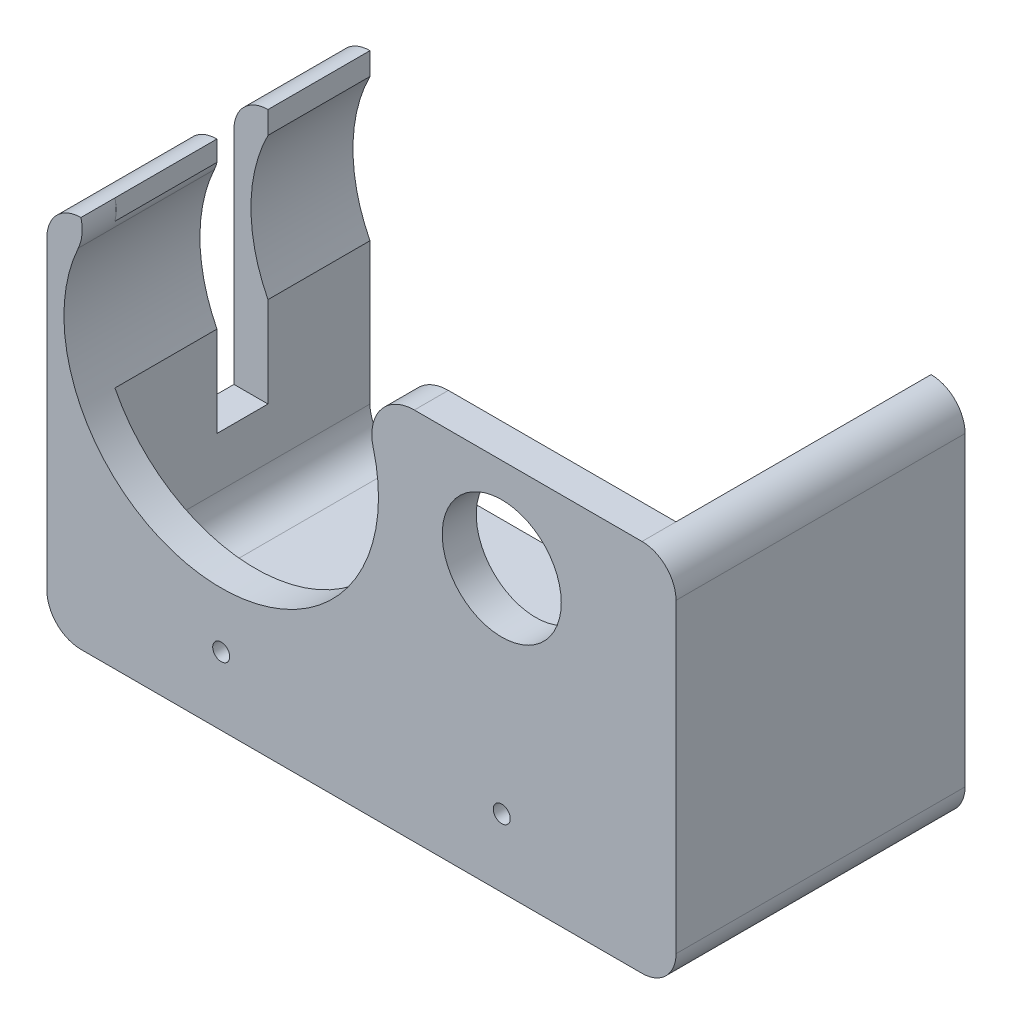
ISO-10303-21;
HEADER;
FILE_DESCRIPTION(('STEP AP214'),'2;1');
FILE_NAME('part.step','',(''),(''),'','','');
FILE_SCHEMA(('AUTOMOTIVE_DESIGN { 1 0 10303 214 1 1 1 1 }'));
ENDSEC;
DATA;
#1=APPLICATION_CONTEXT('core data for automotive mechanical design processes');
#2=APPLICATION_PROTOCOL_DEFINITION('international standard','automotive_design',2000,#1);
#3=PRODUCT_CONTEXT('',#1,'mechanical');
#4=PRODUCT('Part','Part','',(#3));
#5=PRODUCT_RELATED_PRODUCT_CATEGORY('part','',(#4));
#6=PRODUCT_DEFINITION_FORMATION('','',#4);
#7=PRODUCT_DEFINITION_CONTEXT('part definition',#1,'design');
#8=PRODUCT_DEFINITION('design','',#6,#7);
#9=PRODUCT_DEFINITION_SHAPE('','',#8);
#10=(LENGTH_UNIT() NAMED_UNIT(*) SI_UNIT(.MILLI.,.METRE.));
#11=(NAMED_UNIT(*) PLANE_ANGLE_UNIT() SI_UNIT($,.RADIAN.));
#12=(NAMED_UNIT(*) SI_UNIT($,.STERADIAN.) SOLID_ANGLE_UNIT());
#13=UNCERTAINTY_MEASURE_WITH_UNIT(LENGTH_MEASURE(1.E-05),#10,'distance_accuracy_value','');
#14=(GEOMETRIC_REPRESENTATION_CONTEXT(3) GLOBAL_UNCERTAINTY_ASSIGNED_CONTEXT((#13)) GLOBAL_UNIT_ASSIGNED_CONTEXT((#10,
#11,#12)) REPRESENTATION_CONTEXT('',''));
#15=CARTESIAN_POINT('',(0.,0.,0.));
#16=DIRECTION('',(0.,0.,1.));
#17=DIRECTION('',(1.,0.,0.));
#18=AXIS2_PLACEMENT_3D('',#15,#16,#17);
#19=CARTESIAN_POINT('',(-37.2261613691932,29.0880195599022,0.));
#20=DIRECTION('',(0.,0.,1.));
#21=DIRECTION('',(1.,0.,0.));
#22=AXIS2_PLACEMENT_3D('',#19,#20,#21);
#23=CYLINDRICAL_SURFACE('',#22,18.5);
#24=DIRECTION('',(0.,0.,1.));
#25=VECTOR('',#24,1.);
#26=CARTESIAN_POINT('',(-53.7261613691931,37.454619825243,-30.));
#27=LINE('',#26,#25);
#28=CARTESIAN_POINT('',(-53.7261613691931,37.454619825243,-30.));
#29=VERTEX_POINT('',#28);
#30=CARTESIAN_POINT('',(-53.7261613691931,37.454619825243,-18.));
#31=VERTEX_POINT('',#30);
#32=EDGE_CURVE('E355',#29,#31,#27,.T.);
#33=ORIENTED_EDGE('',*,*,#32,.T.);
#34=CARTESIAN_POINT('',(-37.2261613691932,29.0880195599022,-18.));
#35=DIRECTION('',(0.,0.,-1.));
#36=DIRECTION('',(0.,1.,0.));
#37=AXIS2_PLACEMENT_3D('',#34,#35,#36);
#38=CIRCLE('',#37,18.5);
#39=CARTESIAN_POINT('',(-53.7261613691932,20.7214192945614,-18.));
#40=VERTEX_POINT('',#39);
#41=EDGE_CURVE('E297',#31,#40,#38,.F.);
#42=ORIENTED_EDGE('',*,*,#41,.T.);
#43=DIRECTION('',(0.,0.,1.));
#44=VECTOR('',#43,1.);
#45=CARTESIAN_POINT('',(-53.7261613691931,20.7214192945614,-30.));
#46=LINE('',#45,#44);
#47=CARTESIAN_POINT('',(-53.7261613691931,20.7214192945614,-30.));
#48=VERTEX_POINT('',#47);
#49=EDGE_CURVE('E351',#48,#40,#46,.T.);
#50=ORIENTED_EDGE('',*,*,#49,.F.);
#51=CARTESIAN_POINT('',(-37.2261613691932,29.0880195599022,-30.));
#52=DIRECTION('',(0.,0.,-1.));
#53=DIRECTION('',(-1.,0.,0.));
#54=AXIS2_PLACEMENT_3D('',#51,#52,#53);
#55=CIRCLE('',#54,18.5);
#56=EDGE_CURVE('E326',#29,#48,#55,.F.);
#57=ORIENTED_EDGE('',*,*,#56,.F.);
#58=EDGE_LOOP('',(#33,#42,#50,#57));
#59=FACE_BOUND('',#58,.T.);
#60=ADVANCED_FACE('F41',(#59),#23,.F.);
#61=CARTESIAN_POINT('',(-53.7261613691932,0.,-30.));
#62=DIRECTION('',(-1.,0.,0.));
#63=DIRECTION('',(0.,-1.,0.));
#64=AXIS2_PLACEMENT_3D('',#61,#62,#63);
#65=PLANE('',#64);
#66=DIRECTION('',(0.,0.,1.));
#67=VECTOR('',#66,1.);
#68=CARTESIAN_POINT('',(-53.7261613691931,40.0880195599022,-30.));
#69=LINE('',#68,#67);
#70=CARTESIAN_POINT('',(-53.7261613691931,40.0880195599022,-30.));
#71=VERTEX_POINT('',#70);
#72=CARTESIAN_POINT('',(-53.7261613691932,40.0880195599022,-18.));
#73=VERTEX_POINT('',#72);
#74=EDGE_CURVE('E360',#71,#73,#69,.T.);
#75=ORIENTED_EDGE('',*,*,#74,.T.);
#76=DIRECTION('',(0.,-1.,0.));
#77=VECTOR('',#76,1.);
#78=CARTESIAN_POINT('',(-53.7261613691932,0.,-18.));
#79=LINE('',#78,#77);
#80=EDGE_CURVE('E293',#73,#31,#79,.T.);
#81=ORIENTED_EDGE('',*,*,#80,.T.);
#82=ORIENTED_EDGE('',*,*,#32,.F.);
#83=DIRECTION('',(0.,-1.,0.));
#84=VECTOR('',#83,1.);
#85=CARTESIAN_POINT('',(-53.7261613691932,0.,-30.));
#86=LINE('',#85,#84);
#87=EDGE_CURVE('E323',#71,#29,#86,.T.);
#88=ORIENTED_EDGE('',*,*,#87,.F.);
#89=EDGE_LOOP('',(#75,#81,#82,#88));
#90=FACE_BOUND('',#89,.T.);
#91=ADVANCED_FACE('F599',(#90),#65,.F.);
#92=CARTESIAN_POINT('',(-53.7261613691932,36.0880195599022,4.));
#93=DIRECTION('',(0.,0.,-1.));
#94=DIRECTION('',(-1.,0.,0.));
#95=AXIS2_PLACEMENT_3D('',#92,#93,#94);
#96=CYLINDRICAL_SURFACE('',#95,4.);
#97=CARTESIAN_POINT('',(-53.7261613691932,36.0880195599022,-18.));
#98=DIRECTION('',(0.,0.,-1.));
#99=DIRECTION('',(0.,1.,0.));
#100=AXIS2_PLACEMENT_3D('',#97,#98,#99);
#101=CIRCLE('',#100,4.);
#102=CARTESIAN_POINT('',(-57.7261613691932,36.0880195599022,-18.));
#103=VERTEX_POINT('',#102);
#104=EDGE_CURVE('E491',#73,#103,#101,.F.);
#105=ORIENTED_EDGE('',*,*,#104,.F.);
#106=ORIENTED_EDGE('',*,*,#74,.F.);
#107=CARTESIAN_POINT('',(-53.7261613691932,36.0880195599022,-30.));
#108=DIRECTION('',(0.,0.,-1.));
#109=DIRECTION('',(-1.,0.,0.));
#110=AXIS2_PLACEMENT_3D('',#107,#108,#109);
#111=CIRCLE('',#110,4.);
#112=CARTESIAN_POINT('',(-57.7261613691932,36.0880195599022,-30.));
#113=VERTEX_POINT('',#112);
#114=EDGE_CURVE('E430',#113,#71,#111,.T.);
#115=ORIENTED_EDGE('',*,*,#114,.F.);
#116=DIRECTION('',(0.,0.,-1.));
#117=VECTOR('',#116,1.);
#118=CARTESIAN_POINT('',(-57.7261613691932,36.0880195599022,4.));
#119=LINE('',#118,#117);
#120=EDGE_CURVE('E439',#103,#113,#119,.T.);
#121=ORIENTED_EDGE('',*,*,#120,.F.);
#122=EDGE_LOOP('',(#105,#106,#115,#121));
#123=FACE_BOUND('',#122,.T.);
#124=ADVANCED_FACE('F595',(#123),#96,.T.);
#125=CARTESIAN_POINT('',(0.,0.,0.));
#126=DIRECTION('',(0.,0.,1.));
#127=DIRECTION('',(1.,0.,0.));
#128=AXIS2_PLACEMENT_3D('',#125,#126,#127);
#129=PLANE('',#128);
#130=DIRECTION('',(0.,-1.,0.));
#131=VECTOR('',#130,1.);
#132=CARTESIAN_POINT('',(-53.7261613691932,0.,0.));
#133=LINE('',#132,#131);
#134=CARTESIAN_POINT('',(-53.7261613691931,40.0880195599022,0.));
#135=VERTEX_POINT('',#134);
#136=CARTESIAN_POINT('',(-53.7261613691931,37.7027862382972,0.));
#137=VERTEX_POINT('',#136);
#138=EDGE_CURVE('E338',#135,#137,#133,.T.);
#139=ORIENTED_EDGE('',*,*,#138,.F.);
#140=CARTESIAN_POINT('',(-58.5818452036676,38.8954028990997,0.));
#141=DIRECTION('',(0.,0.,1.));
#142=DIRECTION('',(1.,0.,0.));
#143=AXIS2_PLACEMENT_3D('',#140,#141,#142);
#144=CIRCLE('',#143,5.);
#145=EDGE_CURVE('E498',#135,#137,#144,.F.);
#146=ORIENTED_EDGE('',*,*,#145,.T.);
#147=EDGE_LOOP('',(#139,#146));
#148=FACE_BOUND('',#147,.T.);
#149=ADVANCED_FACE('F662',(#148),#129,.F.);
#150=CARTESIAN_POINT('',(-57.7261613691932,40.0880195599022,4.));
#151=DIRECTION('',(0.,-1.,0.));
#152=DIRECTION('',(0.,0.,-1.));
#153=AXIS2_PLACEMENT_3D('',#150,#151,#152);
#154=PLANE('',#153);
#155=DIRECTION('',(-1.,0.,0.));
#156=VECTOR('',#155,1.);
#157=CARTESIAN_POINT('',(-57.7261613691932,40.0880195599022,0.));
#158=LINE('',#157,#156);
#159=CARTESIAN_POINT('',(12.2738386308068,40.0880195599022,0.));
#160=VERTEX_POINT('',#159);
#161=CARTESIAN_POINT('',(-14.5050258341896,40.0880195599022,0.));
#162=VERTEX_POINT('',#161);
#163=EDGE_CURVE('E395',#160,#162,#158,.T.);
#164=ORIENTED_EDGE('',*,*,#163,.T.);
#165=DIRECTION('',(0.,0.,1.));
#166=VECTOR('',#165,1.);
#167=CARTESIAN_POINT('',(-14.5050258341896,40.0880195599022,4.));
#168=LINE('',#167,#166);
#169=CARTESIAN_POINT('',(-14.5050258341896,40.0880195599022,4.));
#170=VERTEX_POINT('',#169);
#171=EDGE_CURVE('E50',#162,#170,#168,.T.);
#172=ORIENTED_EDGE('',*,*,#171,.T.);
#173=DIRECTION('',(-1.,0.,0.));
#174=VECTOR('',#173,1.);
#175=CARTESIAN_POINT('',(-57.7261613691932,40.0880195599022,4.));
#176=LINE('',#175,#174);
#177=CARTESIAN_POINT('',(12.2738386308068,40.0880195599022,4.));
#178=VERTEX_POINT('',#177);
#179=EDGE_CURVE('E408',#178,#170,#176,.T.);
#180=ORIENTED_EDGE('',*,*,#179,.F.);
#181=DIRECTION('',(0.,0.,-1.));
#182=VECTOR('',#181,1.);
#183=CARTESIAN_POINT('',(12.2738386308068,40.0880195599022,4.));
#184=LINE('',#183,#182);
#185=EDGE_CURVE('E480',#178,#160,#184,.T.);
#186=ORIENTED_EDGE('',*,*,#185,.T.);
#187=EDGE_LOOP('',(#164,#172,#180,#186));
#188=FACE_BOUND('',#187,.T.);
#189=ADVANCED_FACE('F523',(#188),#154,.F.);
#190=CARTESIAN_POINT('',(-57.7261613691932,40.0880195599022,4.));
#191=DIRECTION('',(1.,0.,0.));
#192=DIRECTION('',(0.,1.,0.));
#193=AXIS2_PLACEMENT_3D('',#190,#191,#192);
#194=PLANE('',#193);
#195=DIRECTION('',(0.,0.,1.));
#196=VECTOR('',#195,1.);
#197=CARTESIAN_POINT('',(-57.7261613691931,10.0880195599022,-18.));
#198=LINE('',#197,#196);
#199=CARTESIAN_POINT('',(-57.7261613691931,10.0880195599022,-18.));
#200=VERTEX_POINT('',#199);
#201=CARTESIAN_POINT('',(-57.7261613691931,10.0880195599022,-12.));
#202=VERTEX_POINT('',#201);
#203=EDGE_CURVE('E269',#200,#202,#198,.T.);
#204=ORIENTED_EDGE('',*,*,#203,.F.);
#205=DIRECTION('',(0.,-1.,0.));
#206=VECTOR('',#205,1.);
#207=CARTESIAN_POINT('',(-57.7261613691932,40.0880195599022,-18.));
#208=LINE('',#207,#206);
#209=EDGE_CURVE('E260',#103,#200,#208,.T.);
#210=ORIENTED_EDGE('',*,*,#209,.F.);
#211=ORIENTED_EDGE('',*,*,#120,.T.);
#212=DIRECTION('',(0.,1.,0.));
#213=VECTOR('',#212,1.);
#214=CARTESIAN_POINT('',(-57.7261613691931,0.,-30.));
#215=LINE('',#214,#213);
#216=CARTESIAN_POINT('',(-57.7261613691931,0.088019559902202,-30.));
#217=VERTEX_POINT('',#216);
#218=EDGE_CURVE('E319',#217,#113,#215,.T.);
#219=ORIENTED_EDGE('',*,*,#218,.F.);
#220=DIRECTION('',(0.,0.,-1.));
#221=VECTOR('',#220,1.);
#222=CARTESIAN_POINT('',(-57.7261613691931,0.0880195599022027,4.));
#223=LINE('',#222,#221);
#224=CARTESIAN_POINT('',(-57.7261613691931,0.0880195599022027,4.));
#225=VERTEX_POINT('',#224);
#226=EDGE_CURVE('E444',#217,#225,#223,.F.);
#227=ORIENTED_EDGE('',*,*,#226,.T.);
#228=DIRECTION('',(0.,-1.,0.));
#229=VECTOR('',#228,1.);
#230=CARTESIAN_POINT('',(-57.7261613691932,40.0880195599022,4.));
#231=LINE('',#230,#229);
#232=CARTESIAN_POINT('',(-57.7261613691932,36.0880195599022,4.));
#233=VERTEX_POINT('',#232);
#234=EDGE_CURVE('E396',#233,#225,#231,.T.);
#235=ORIENTED_EDGE('',*,*,#234,.F.);
#236=CARTESIAN_POINT('',(-57.7261613691932,36.0880195599022,-12.));
#237=VERTEX_POINT('',#236);
#238=EDGE_CURVE('E440',#233,#237,#119,.T.);
#239=ORIENTED_EDGE('',*,*,#238,.T.);
#240=DIRECTION('',(0.,1.,0.));
#241=VECTOR('',#240,1.);
#242=CARTESIAN_POINT('',(-57.7261613691932,40.0880195599022,-12.));
#243=LINE('',#242,#241);
#244=EDGE_CURVE('E273',#202,#237,#243,.T.);
#245=ORIENTED_EDGE('',*,*,#244,.F.);
#246=EDGE_LOOP('',(#204,#210,#211,#219,#227,#235,#239,#245));
#247=FACE_BOUND('',#246,.T.);
#248=ADVANCED_FACE('F586',(#247),#194,.F.);
#249=CARTESIAN_POINT('',(-57.7261613691931,-3.9119804400978,4.));
#250=DIRECTION('',(0.,1.,0.));
#251=DIRECTION('',(0.,0.,1.));
#252=AXIS2_PLACEMENT_3D('',#249,#250,#251);
#253=PLANE('',#252);
#254=DIRECTION('',(0.,0.,-1.));
#255=VECTOR('',#254,1.);
#256=CARTESIAN_POINT('',(12.2738386308068,-3.9119804400978,4.));
#257=LINE('',#256,#255);
#258=CARTESIAN_POINT('',(12.2738386308068,-3.9119804400978,-30.));
#259=VERTEX_POINT('',#258);
#260=CARTESIAN_POINT('',(12.2738386308068,-3.9119804400978,-16.));
#261=VERTEX_POINT('',#260);
#262=EDGE_CURVE('E420',#259,#261,#257,.F.);
#263=ORIENTED_EDGE('',*,*,#262,.T.);
#264=DIRECTION('',(-1.,0.,0.));
#265=VECTOR('',#264,1.);
#266=CARTESIAN_POINT('',(7.27383863080683,-3.9119804400978,-16.));
#267=LINE('',#266,#265);
#268=CARTESIAN_POINT('',(7.27383863080683,-3.9119804400978,-16.));
#269=VERTEX_POINT('',#268);
#270=EDGE_CURVE('E65',#261,#269,#267,.T.);
#271=ORIENTED_EDGE('',*,*,#270,.T.);
#272=DIRECTION('',(0.,0.,1.));
#273=VECTOR('',#272,1.);
#274=CARTESIAN_POINT('',(7.27383863080683,-3.9119804400978,-16.));
#275=LINE('',#274,#273);
#276=CARTESIAN_POINT('',(7.27383863080683,-3.9119804400978,-6.));
#277=VERTEX_POINT('',#276);
#278=EDGE_CURVE('E222',#269,#277,#275,.T.);
#279=ORIENTED_EDGE('',*,*,#278,.T.);
#280=DIRECTION('',(1.,0.,0.));
#281=VECTOR('',#280,1.);
#282=CARTESIAN_POINT('',(7.27383863080683,-3.9119804400978,-6.));
#283=LINE('',#282,#281);
#284=CARTESIAN_POINT('',(12.2738386308068,-3.9119804400978,-6.));
#285=VERTEX_POINT('',#284);
#286=EDGE_CURVE('E230',#277,#285,#283,.T.);
#287=ORIENTED_EDGE('',*,*,#286,.T.);
#288=CARTESIAN_POINT('',(12.2738386308068,-3.9119804400978,4.));
#289=VERTEX_POINT('',#288);
#290=EDGE_CURVE('E419',#285,#289,#257,.F.);
#291=ORIENTED_EDGE('',*,*,#290,.T.);
#292=DIRECTION('',(1.,0.,0.));
#293=VECTOR('',#292,1.);
#294=CARTESIAN_POINT('',(-57.7261613691931,-3.9119804400978,4.));
#295=LINE('',#294,#293);
#296=CARTESIAN_POINT('',(-53.7261613691932,-3.9119804400978,4.));
#297=VERTEX_POINT('',#296);
#298=EDGE_CURVE('E400',#297,#289,#295,.T.);
#299=ORIENTED_EDGE('',*,*,#298,.F.);
#300=DIRECTION('',(0.,0.,-1.));
#301=VECTOR('',#300,1.);
#302=CARTESIAN_POINT('',(-53.7261613691932,-3.9119804400978,4.));
#303=LINE('',#302,#301);
#304=CARTESIAN_POINT('',(-53.7261613691932,-3.9119804400978,-30.));
#305=VERTEX_POINT('',#304);
#306=EDGE_CURVE('E423',#297,#305,#303,.T.);
#307=ORIENTED_EDGE('',*,*,#306,.T.);
#308=DIRECTION('',(-1.,0.,0.));
#309=VECTOR('',#308,1.);
#310=CARTESIAN_POINT('',(0.,-3.9119804400978,-30.));
#311=LINE('',#310,#309);
#312=EDGE_CURVE('E315',#259,#305,#311,.T.);
#313=ORIENTED_EDGE('',*,*,#312,.F.);
#314=EDGE_LOOP('',(#263,#271,#279,#287,#291,#299,#307,#313));
#315=FACE_BOUND('',#314,.T.);
#316=ADVANCED_FACE('F239',(#315),#253,.F.);
#317=CARTESIAN_POINT('',(16.2738386308068,40.0880195599022,4.));
#318=DIRECTION('',(-1.,0.,0.));
#319=DIRECTION('',(0.,-1.,0.));
#320=AXIS2_PLACEMENT_3D('',#317,#318,#319);
#321=PLANE('',#320);
#322=DIRECTION('',(0.,1.,0.));
#323=VECTOR('',#322,1.);
#324=CARTESIAN_POINT('',(16.2738386308068,40.0880195599022,4.));
#325=LINE('',#324,#323);
#326=CARTESIAN_POINT('',(16.2738386308068,0.0880195599022027,4.));
#327=VERTEX_POINT('',#326);
#328=CARTESIAN_POINT('',(16.2738386308068,36.0880195599022,4.));
#329=VERTEX_POINT('',#328);
#330=EDGE_CURVE('E404',#327,#329,#325,.T.);
#331=ORIENTED_EDGE('',*,*,#330,.F.);
#332=DIRECTION('',(0.,0.,-1.));
#333=VECTOR('',#332,1.);
#334=CARTESIAN_POINT('',(16.2738386308068,0.0880195599022027,4.));
#335=LINE('',#334,#333);
#336=CARTESIAN_POINT('',(16.2738386308068,0.0880195599022033,-30.));
#337=VERTEX_POINT('',#336);
#338=EDGE_CURVE('E472',#327,#337,#335,.T.);
#339=ORIENTED_EDGE('',*,*,#338,.T.);
#340=DIRECTION('',(0.,-1.,0.));
#341=VECTOR('',#340,1.);
#342=CARTESIAN_POINT('',(16.2738386308068,0.,-30.));
#343=LINE('',#342,#341);
#344=CARTESIAN_POINT('',(16.2738386308068,36.0880195599022,-30.));
#345=VERTEX_POINT('',#344);
#346=EDGE_CURVE('E310',#345,#337,#343,.T.);
#347=ORIENTED_EDGE('',*,*,#346,.F.);
#348=DIRECTION('',(0.,0.,-1.));
#349=VECTOR('',#348,1.);
#350=CARTESIAN_POINT('',(16.2738386308068,36.0880195599022,4.));
#351=LINE('',#350,#349);
#352=EDGE_CURVE('E469',#345,#329,#351,.F.);
#353=ORIENTED_EDGE('',*,*,#352,.T.);
#354=EDGE_LOOP('',(#331,#339,#347,#353));
#355=FACE_BOUND('',#354,.T.);
#356=ADVANCED_FACE('F570',(#355),#321,.F.);
#357=CARTESIAN_POINT('',(0.,0.,4.));
#358=DIRECTION('',(0.,0.,1.));
#359=DIRECTION('',(1.,0.,0.));
#360=AXIS2_PLACEMENT_3D('',#357,#358,#359);
#361=PLANE('',#360);
#362=CARTESIAN_POINT('',(-37.2261613691932,4.0880195599022,4.));
#363=DIRECTION('',(0.,0.,1.));
#364=DIRECTION('',(1.,0.,0.));
#365=AXIS2_PLACEMENT_3D('',#362,#363,#364);
#366=CIRCLE('',#365,0.999999999999998);
#367=CARTESIAN_POINT('',(-36.2261613691932,4.0880195599022,4.));
#368=VERTEX_POINT('',#367);
#369=EDGE_CURVE('E367',#368,#368,#366,.T.);
#370=ORIENTED_EDGE('',*,*,#369,.F.);
#371=EDGE_LOOP('',(#370));
#372=FACE_BOUND('',#371,.T.);
#373=CARTESIAN_POINT('',(-4.22616136919315,4.08801955990221,4.));
#374=DIRECTION('',(0.,0.,1.));
#375=DIRECTION('',(1.,0.,0.));
#376=AXIS2_PLACEMENT_3D('',#373,#374,#375);
#377=CIRCLE('',#376,0.999999999999998);
#378=CARTESIAN_POINT('',(-3.22616136919316,4.08801955990221,4.));
#379=VERTEX_POINT('',#378);
#380=EDGE_CURVE('E381',#379,#379,#377,.T.);
#381=ORIENTED_EDGE('',*,*,#380,.F.);
#382=EDGE_LOOP('',(#381));
#383=FACE_BOUND('',#382,.T.);
#384=CARTESIAN_POINT('',(-4.22616136919316,29.0880195599022,4.));
#385=DIRECTION('',(0.,0.,1.));
#386=DIRECTION('',(1.,0.,0.));
#387=AXIS2_PLACEMENT_3D('',#384,#385,#386);
#388=CIRCLE('',#387,7.);
#389=CARTESIAN_POINT('',(2.77383863080684,29.0880195599022,4.));
#390=VERTEX_POINT('',#389);
#391=EDGE_CURVE('E373',#390,#390,#388,.T.);
#392=ORIENTED_EDGE('',*,*,#391,.F.);
#393=EDGE_LOOP('',(#392));
#394=FACE_BOUND('',#393,.T.);
#395=CARTESIAN_POINT('',(-37.2261613691932,29.0880195599022,4.));
#396=DIRECTION('',(0.,0.,1.));
#397=DIRECTION('',(1.,0.,0.));
#398=AXIS2_PLACEMENT_3D('',#395,#396,#397);
#399=CIRCLE('',#398,18.5);
#400=CARTESIAN_POINT('',(-54.0380826856943,36.8087255928874,4.));
#401=VERTEX_POINT('',#400);
#402=CARTESIAN_POINT('',(-19.3393099905734,33.8114238152213,4.));
#403=VERTEX_POINT('',#402);
#404=EDGE_CURVE('E372',#401,#403,#399,.T.);
#405=ORIENTED_EDGE('',*,*,#404,.F.);
#406=CARTESIAN_POINT('',(-58.5818452036676,38.8954028990997,4.));
#407=DIRECTION('',(0.,0.,1.));
#408=DIRECTION('',(1.,0.,0.));
#409=AXIS2_PLACEMENT_3D('',#406,#407,#408);
#410=CIRCLE('',#409,5.);
#411=CARTESIAN_POINT('',(-53.7261613691932,40.0880195599022,4.));
#412=VERTEX_POINT('',#411);
#413=EDGE_CURVE('E516',#401,#412,#410,.T.);
#414=ORIENTED_EDGE('',*,*,#413,.T.);
#415=CARTESIAN_POINT('',(-53.7261613691932,36.0880195599022,4.));
#416=DIRECTION('',(0.,0.,1.));
#417=DIRECTION('',(1.,0.,0.));
#418=AXIS2_PLACEMENT_3D('',#415,#416,#417);
#419=CIRCLE('',#418,4.);
#420=EDGE_CURVE('E450',#412,#233,#419,.T.);
#421=ORIENTED_EDGE('',*,*,#420,.T.);
#422=ORIENTED_EDGE('',*,*,#234,.T.);
#423=CARTESIAN_POINT('',(-53.7261613691932,0.0880195599022027,4.));
#424=DIRECTION('',(0.,0.,1.));
#425=DIRECTION('',(1.,0.,0.));
#426=AXIS2_PLACEMENT_3D('',#423,#424,#425);
#427=CIRCLE('',#426,4.);
#428=EDGE_CURVE('E456',#225,#297,#427,.T.);
#429=ORIENTED_EDGE('',*,*,#428,.T.);
#430=ORIENTED_EDGE('',*,*,#298,.T.);
#431=CARTESIAN_POINT('',(12.2738386308068,0.0880195599022027,4.));
#432=DIRECTION('',(0.,0.,1.));
#433=DIRECTION('',(1.,0.,0.));
#434=AXIS2_PLACEMENT_3D('',#431,#432,#433);
#435=CIRCLE('',#434,4.);
#436=EDGE_CURVE('E453',#289,#327,#435,.T.);
#437=ORIENTED_EDGE('',*,*,#436,.T.);
#438=ORIENTED_EDGE('',*,*,#330,.T.);
#439=CARTESIAN_POINT('',(12.2738386308068,36.0880195599022,4.));
#440=DIRECTION('',(0.,0.,1.));
#441=DIRECTION('',(1.,0.,0.));
#442=AXIS2_PLACEMENT_3D('',#439,#440,#441);
#443=CIRCLE('',#442,4.);
#444=EDGE_CURVE('E447',#329,#178,#443,.T.);
#445=ORIENTED_EDGE('',*,*,#444,.T.);
#446=ORIENTED_EDGE('',*,*,#179,.T.);
#447=CARTESIAN_POINT('',(-14.5050258341896,35.0880195599022,4.));
#448=DIRECTION('',(0.,0.,1.));
#449=DIRECTION('',(1.,0.,0.));
#450=AXIS2_PLACEMENT_3D('',#447,#448,#449);
#451=CIRCLE('',#450,5.);
#452=EDGE_CURVE('E513',#170,#403,#451,.T.);
#453=ORIENTED_EDGE('',*,*,#452,.T.);
#454=EDGE_LOOP('',(#405,#414,#421,#422,#429,#430,#437,#438,#445,#446,#453));
#455=FACE_BOUND('',#454,.T.);
#456=ADVANCED_FACE('F530',(#372,#383,#394,#455),#361,.T.);
#457=CARTESIAN_POINT('',(-37.2261613691932,4.0880195599022,0.));
#458=DIRECTION('',(0.,0.,1.));
#459=DIRECTION('',(1.,0.,0.));
#460=AXIS2_PLACEMENT_3D('',#457,#458,#459);
#461=CIRCLE('',#460,0.999999999999998);
#462=CARTESIAN_POINT('',(-36.2261613691932,4.0880195599022,0.));
#463=VERTEX_POINT('',#462);
#464=EDGE_CURVE('E385',#463,#463,#461,.T.);
#465=ORIENTED_EDGE('',*,*,#464,.T.);
#466=EDGE_LOOP('',(#465));
#467=FACE_BOUND('',#466,.T.);
#468=CARTESIAN_POINT('',(-4.22616136919315,4.08801955990221,0.));
#469=DIRECTION('',(0.,0.,1.));
#470=DIRECTION('',(1.,0.,0.));
#471=AXIS2_PLACEMENT_3D('',#468,#469,#470);
#472=CIRCLE('',#471,0.999999999999998);
#473=CARTESIAN_POINT('',(-3.22616136919316,4.08801955990221,0.));
#474=VERTEX_POINT('',#473);
#475=EDGE_CURVE('E377',#474,#474,#472,.T.);
#476=ORIENTED_EDGE('',*,*,#475,.T.);
#477=EDGE_LOOP('',(#476));
#478=FACE_BOUND('',#477,.T.);
#479=CARTESIAN_POINT('',(-4.22616136919316,29.0880195599022,0.));
#480=DIRECTION('',(0.,0.,1.));
#481=DIRECTION('',(1.,0.,0.));
#482=AXIS2_PLACEMENT_3D('',#479,#480,#481);
#483=CIRCLE('',#482,7.);
#484=CARTESIAN_POINT('',(2.77383863080684,29.0880195599022,0.));
#485=VERTEX_POINT('',#484);
#486=EDGE_CURVE('E368',#485,#485,#483,.T.);
#487=ORIENTED_EDGE('',*,*,#486,.T.);
#488=EDGE_LOOP('',(#487));
#489=FACE_BOUND('',#488,.T.);
#490=CARTESIAN_POINT('',(-37.2261613691932,29.0880195599022,0.));
#491=DIRECTION('',(0.,0.,1.));
#492=DIRECTION('',(1.,0.,0.));
#493=AXIS2_PLACEMENT_3D('',#490,#491,#492);
#494=CIRCLE('',#493,18.5);
#495=CARTESIAN_POINT('',(-53.7261613691931,20.7214192945614,0.));
#496=VERTEX_POINT('',#495);
#497=CARTESIAN_POINT('',(-19.3393099905734,33.8114238152213,0.));
#498=VERTEX_POINT('',#497);
#499=EDGE_CURVE('E412',#496,#498,#494,.T.);
#500=ORIENTED_EDGE('',*,*,#499,.T.);
#501=CARTESIAN_POINT('',(-14.5050258341896,35.0880195599022,0.));
#502=DIRECTION('',(0.,0.,1.));
#503=DIRECTION('',(1.,0.,0.));
#504=AXIS2_PLACEMENT_3D('',#501,#502,#503);
#505=CIRCLE('',#504,5.);
#506=EDGE_CURVE('E12',#498,#162,#505,.F.);
#507=ORIENTED_EDGE('',*,*,#506,.T.);
#508=ORIENTED_EDGE('',*,*,#163,.F.);
#509=DIRECTION('',(0.,-1.,0.));
#510=VECTOR('',#509,1.);
#511=CARTESIAN_POINT('',(12.2738386308068,0.,0.));
#512=LINE('',#511,#510);
#513=CARTESIAN_POINT('',(12.2738386308068,0.0880195599022027,0.));
#514=VERTEX_POINT('',#513);
#515=EDGE_CURVE('E305',#160,#514,#512,.T.);
#516=ORIENTED_EDGE('',*,*,#515,.T.);
#517=DIRECTION('',(-1.,0.,0.));
#518=VECTOR('',#517,1.);
#519=CARTESIAN_POINT('',(0.,0.0880195599022027,0.));
#520=LINE('',#519,#518);
#521=CARTESIAN_POINT('',(-49.7261613691932,0.0880195599022027,0.));
#522=VERTEX_POINT('',#521);
#523=EDGE_CURVE('E311',#514,#522,#520,.T.);
#524=ORIENTED_EDGE('',*,*,#523,.T.);
#525=CARTESIAN_POINT('',(-49.7261613691932,4.0880195599022,0.));
#526=DIRECTION('',(0.,0.,1.));
#527=DIRECTION('',(1.,0.,0.));
#528=AXIS2_PLACEMENT_3D('',#525,#526,#527);
#529=CIRCLE('',#528,4.);
#530=CARTESIAN_POINT('',(-53.7261613691932,4.0880195599022,0.));
#531=VERTEX_POINT('',#530);
#532=EDGE_CURVE('E463',#522,#531,#529,.F.);
#533=ORIENTED_EDGE('',*,*,#532,.T.);
#534=EDGE_CURVE('E342',#496,#531,#133,.T.);
#535=ORIENTED_EDGE('',*,*,#534,.F.);
#536=EDGE_LOOP('',(#500,#507,#508,#516,#524,#533,#535));
#537=FACE_BOUND('',#536,.T.);
#538=ADVANCED_FACE('F539',(#467,#478,#489,#537),#129,.F.);
#539=CARTESIAN_POINT('',(-37.2261613691932,29.0880195599022,-12.));
#540=DIRECTION('',(0.,0.,1.));
#541=DIRECTION('',(0.,-1.,0.));
#542=AXIS2_PLACEMENT_3D('',#539,#540,#541);
#543=CIRCLE('',#542,18.5);
#544=CARTESIAN_POINT('',(-53.7261613691932,20.7214192945614,-12.));
#545=VERTEX_POINT('',#544);
#546=CARTESIAN_POINT('',(-54.0380826856943,36.8087255928874,-12.));
#547=VERTEX_POINT('',#546);
#548=EDGE_CURVE('E285',#545,#547,#543,.F.);
#549=ORIENTED_EDGE('',*,*,#548,.T.);
#550=DIRECTION('',(0.,0.,1.));
#551=VECTOR('',#550,1.);
#552=CARTESIAN_POINT('',(-54.0380826856943,36.8087255928874,0.));
#553=LINE('',#552,#551);
#554=EDGE_CURVE('E510',#547,#401,#553,.T.);
#555=ORIENTED_EDGE('',*,*,#554,.T.);
#556=ORIENTED_EDGE('',*,*,#404,.T.);
#557=DIRECTION('',(0.,0.,1.));
#558=VECTOR('',#557,1.);
#559=CARTESIAN_POINT('',(-19.3393099905734,33.8114238152213,0.));
#560=LINE('',#559,#558);
#561=EDGE_CURVE('E507',#403,#498,#560,.F.);
#562=ORIENTED_EDGE('',*,*,#561,.T.);
#563=ORIENTED_EDGE('',*,*,#499,.F.);
#564=EDGE_CURVE('E350',#545,#496,#46,.T.);
#565=ORIENTED_EDGE('',*,*,#564,.F.);
#566=EDGE_LOOP('',(#549,#555,#556,#562,#563,#565));
#567=FACE_BOUND('',#566,.T.);
#568=ADVANCED_FACE('F615',(#567),#23,.F.);
#569=CARTESIAN_POINT('',(-4.22616136919316,29.0880195599022,0.));
#570=DIRECTION('',(0.,0.,1.));
#571=DIRECTION('',(1.,0.,0.));
#572=AXIS2_PLACEMENT_3D('',#569,#570,#571);
#573=CYLINDRICAL_SURFACE('',#572,7.);
#574=ORIENTED_EDGE('',*,*,#486,.F.);
#575=EDGE_LOOP('',(#574));
#576=FACE_BOUND('',#575,.T.);
#577=ORIENTED_EDGE('',*,*,#391,.T.);
#578=EDGE_LOOP('',(#577));
#579=FACE_BOUND('',#578,.T.);
#580=ADVANCED_FACE('F651',(#576,#579),#573,.F.);
#581=CARTESIAN_POINT('',(-4.22616136919315,4.08801955990221,0.));
#582=DIRECTION('',(0.,0.,1.));
#583=DIRECTION('',(1.,0.,0.));
#584=AXIS2_PLACEMENT_3D('',#581,#582,#583);
#585=CYLINDRICAL_SURFACE('',#584,0.999999999999998);
#586=ORIENTED_EDGE('',*,*,#475,.F.);
#587=EDGE_LOOP('',(#586));
#588=FACE_BOUND('',#587,.T.);
#589=ORIENTED_EDGE('',*,*,#380,.T.);
#590=EDGE_LOOP('',(#589));
#591=FACE_BOUND('',#590,.T.);
#592=ADVANCED_FACE('F657',(#588,#591),#585,.F.);
#593=CARTESIAN_POINT('',(-37.2261613691932,4.0880195599022,0.));
#594=DIRECTION('',(0.,0.,1.));
#595=DIRECTION('',(1.,0.,0.));
#596=AXIS2_PLACEMENT_3D('',#593,#594,#595);
#597=CYLINDRICAL_SURFACE('',#596,0.999999999999998);
#598=ORIENTED_EDGE('',*,*,#464,.F.);
#599=EDGE_LOOP('',(#598));
#600=FACE_BOUND('',#599,.T.);
#601=ORIENTED_EDGE('',*,*,#369,.T.);
#602=EDGE_LOOP('',(#601));
#603=FACE_BOUND('',#602,.T.);
#604=ADVANCED_FACE('F682',(#600,#603),#597,.F.);
#605=CARTESIAN_POINT('',(12.2738386308068,0.,-30.));
#606=DIRECTION('',(-1.,0.,0.));
#607=DIRECTION('',(0.,-1.,0.));
#608=AXIS2_PLACEMENT_3D('',#605,#606,#607);
#609=PLANE('',#608);
#610=ORIENTED_EDGE('',*,*,#515,.F.);
#611=DIRECTION('',(0.,0.,1.));
#612=VECTOR('',#611,1.);
#613=CARTESIAN_POINT('',(12.2738386308068,40.0880195599022,-30.));
#614=LINE('',#613,#612);
#615=CARTESIAN_POINT('',(12.2738386308068,40.0880195599022,-30.));
#616=VERTEX_POINT('',#615);
#617=EDGE_CURVE('E364',#616,#160,#614,.T.);
#618=ORIENTED_EDGE('',*,*,#617,.F.);
#619=DIRECTION('',(0.,-1.,0.));
#620=VECTOR('',#619,1.);
#621=CARTESIAN_POINT('',(12.2738386308068,0.,-30.));
#622=LINE('',#621,#620);
#623=CARTESIAN_POINT('',(12.2738386308068,0.0880195599022027,-30.));
#624=VERTEX_POINT('',#623);
#625=EDGE_CURVE('E306',#616,#624,#622,.T.);
#626=ORIENTED_EDGE('',*,*,#625,.T.);
#627=DIRECTION('',(0.,0.,1.));
#628=VECTOR('',#627,1.);
#629=CARTESIAN_POINT('',(12.2738386308068,0.0880195599022027,-30.));
#630=LINE('',#629,#628);
#631=CARTESIAN_POINT('',(12.2738386308068,0.0880195599022027,-16.));
#632=VERTEX_POINT('',#631);
#633=EDGE_CURVE('E346',#624,#632,#630,.T.);
#634=ORIENTED_EDGE('',*,*,#633,.T.);
#635=DIRECTION('',(0.,1.,0.));
#636=VECTOR('',#635,1.);
#637=CARTESIAN_POINT('',(12.2738386308068,-3.9119804400978,-16.));
#638=LINE('',#637,#636);
#639=EDGE_CURVE('E261',#261,#632,#638,.T.);
#640=ORIENTED_EDGE('',*,*,#639,.F.);
#641=DIRECTION('',(0.,0.,-1.));
#642=VECTOR('',#641,1.);
#643=CARTESIAN_POINT('',(12.2738386308068,-3.9119804400978,-16.));
#644=LINE('',#643,#642);
#645=EDGE_CURVE('E236',#285,#261,#644,.T.);
#646=ORIENTED_EDGE('',*,*,#645,.F.);
#647=DIRECTION('',(0.,1.,0.));
#648=VECTOR('',#647,1.);
#649=CARTESIAN_POINT('',(12.2738386308068,-3.9119804400978,-6.));
#650=LINE('',#649,#648);
#651=CARTESIAN_POINT('',(12.2738386308068,0.0880195599022027,-6.));
#652=VERTEX_POINT('',#651);
#653=EDGE_CURVE('E227',#285,#652,#650,.T.);
#654=ORIENTED_EDGE('',*,*,#653,.T.);
#655=EDGE_CURVE('E334',#652,#514,#630,.T.);
#656=ORIENTED_EDGE('',*,*,#655,.T.);
#657=EDGE_LOOP('',(#610,#618,#626,#634,#640,#646,#654,#656));
#658=FACE_BOUND('',#657,.T.);
#659=ADVANCED_FACE('F542',(#658),#609,.T.);
#660=ORIENTED_EDGE('',*,*,#138,.T.);
#661=DIRECTION('',(0.,0.,-1.));
#662=VECTOR('',#661,1.);
#663=CARTESIAN_POINT('',(-53.7261613691931,37.7027862382972,0.));
#664=LINE('',#663,#662);
#665=CARTESIAN_POINT('',(-53.7261613691931,37.7027862382972,-12.));
#666=VERTEX_POINT('',#665);
#667=EDGE_CURVE('E501',#137,#666,#664,.T.);
#668=ORIENTED_EDGE('',*,*,#667,.T.);
#669=DIRECTION('',(0.,1.,0.));
#670=VECTOR('',#669,1.);
#671=CARTESIAN_POINT('',(-53.7261613691932,0.,-12.));
#672=LINE('',#671,#670);
#673=CARTESIAN_POINT('',(-53.7261613691932,40.0880195599022,-12.));
#674=VERTEX_POINT('',#673);
#675=EDGE_CURVE('E280',#666,#674,#672,.T.);
#676=ORIENTED_EDGE('',*,*,#675,.T.);
#677=EDGE_CURVE('E359',#674,#135,#69,.T.);
#678=ORIENTED_EDGE('',*,*,#677,.T.);
#679=EDGE_LOOP('',(#660,#668,#676,#678));
#680=FACE_BOUND('',#679,.T.);
#681=ADVANCED_FACE('F647',(#680),#65,.F.);
#682=ORIENTED_EDGE('',*,*,#49,.T.);
#683=DIRECTION('',(0.,-1.,0.));
#684=VECTOR('',#683,1.);
#685=CARTESIAN_POINT('',(-53.7261613691932,0.,-18.));
#686=LINE('',#685,#684);
#687=CARTESIAN_POINT('',(-53.7261613691932,10.0880195599022,-18.));
#688=VERTEX_POINT('',#687);
#689=EDGE_CURVE('E301',#40,#688,#686,.T.);
#690=ORIENTED_EDGE('',*,*,#689,.T.);
#691=DIRECTION('',(0.,0.,1.));
#692=VECTOR('',#691,1.);
#693=CARTESIAN_POINT('',(-53.7261613691932,10.0880195599022,-30.));
#694=LINE('',#693,#692);
#695=CARTESIAN_POINT('',(-53.7261613691932,10.0880195599022,-12.));
#696=VERTEX_POINT('',#695);
#697=EDGE_CURVE('E494',#688,#696,#694,.T.);
#698=ORIENTED_EDGE('',*,*,#697,.T.);
#699=DIRECTION('',(0.,1.,0.));
#700=VECTOR('',#699,1.);
#701=CARTESIAN_POINT('',(-53.7261613691932,0.,-12.));
#702=LINE('',#701,#700);
#703=EDGE_CURVE('E289',#696,#545,#702,.T.);
#704=ORIENTED_EDGE('',*,*,#703,.T.);
#705=ORIENTED_EDGE('',*,*,#564,.T.);
#706=ORIENTED_EDGE('',*,*,#534,.T.);
#707=DIRECTION('',(0.,0.,1.));
#708=VECTOR('',#707,1.);
#709=CARTESIAN_POINT('',(-53.7261613691932,4.0880195599022,-30.));
#710=LINE('',#709,#708);
#711=CARTESIAN_POINT('',(-53.7261613691932,4.0880195599022,-30.));
#712=VERTEX_POINT('',#711);
#713=EDGE_CURVE('E466',#531,#712,#710,.F.);
#714=ORIENTED_EDGE('',*,*,#713,.T.);
#715=EDGE_CURVE('E327',#48,#712,#86,.T.);
#716=ORIENTED_EDGE('',*,*,#715,.F.);
#717=EDGE_LOOP('',(#682,#690,#698,#704,#705,#706,#714,#716));
#718=FACE_BOUND('',#717,.T.);
#719=ADVANCED_FACE('F555',(#718),#65,.F.);
#720=CARTESIAN_POINT('',(0.,0.0880195599022027,-30.));
#721=DIRECTION('',(0.,1.,0.));
#722=DIRECTION('',(0.,0.,1.));
#723=AXIS2_PLACEMENT_3D('',#720,#721,#722);
#724=PLANE('',#723);
#725=DIRECTION('',(-1.,0.,0.));
#726=VECTOR('',#725,1.);
#727=CARTESIAN_POINT('',(7.27383863080683,0.0880195599022027,-16.));
#728=LINE('',#727,#726);
#729=CARTESIAN_POINT('',(7.27383863080683,0.0880195599022027,-16.));
#730=VERTEX_POINT('',#729);
#731=EDGE_CURVE('E241',#632,#730,#728,.T.);
#732=ORIENTED_EDGE('',*,*,#731,.F.);
#733=ORIENTED_EDGE('',*,*,#633,.F.);
#734=DIRECTION('',(-1.,0.,0.));
#735=VECTOR('',#734,1.);
#736=CARTESIAN_POINT('',(0.,0.0880195599022027,-30.));
#737=LINE('',#736,#735);
#738=CARTESIAN_POINT('',(-49.7261613691932,0.0880195599022027,-30.));
#739=VERTEX_POINT('',#738);
#740=EDGE_CURVE('E330',#624,#739,#737,.T.);
#741=ORIENTED_EDGE('',*,*,#740,.T.);
#742=DIRECTION('',(0.,0.,1.));
#743=VECTOR('',#742,1.);
#744=CARTESIAN_POINT('',(-49.7261613691932,0.0880195599022027,-30.));
#745=LINE('',#744,#743);
#746=EDGE_CURVE('E459',#739,#522,#745,.T.);
#747=ORIENTED_EDGE('',*,*,#746,.T.);
#748=ORIENTED_EDGE('',*,*,#523,.F.);
#749=ORIENTED_EDGE('',*,*,#655,.F.);
#750=DIRECTION('',(1.,0.,0.));
#751=VECTOR('',#750,1.);
#752=CARTESIAN_POINT('',(7.27383863080683,0.0880195599022027,-6.));
#753=LINE('',#752,#751);
#754=CARTESIAN_POINT('',(7.27383863080683,0.0880195599022027,-6.));
#755=VERTEX_POINT('',#754);
#756=EDGE_CURVE('E245',#755,#652,#753,.T.);
#757=ORIENTED_EDGE('',*,*,#756,.F.);
#758=DIRECTION('',(0.,0.,1.));
#759=VECTOR('',#758,1.);
#760=CARTESIAN_POINT('',(7.27383863080683,0.0880195599022027,-16.));
#761=LINE('',#760,#759);
#762=EDGE_CURVE('E57',#730,#755,#761,.T.);
#763=ORIENTED_EDGE('',*,*,#762,.F.);
#764=EDGE_LOOP('',(#732,#733,#741,#747,#748,#749,#757,#763));
#765=FACE_BOUND('',#764,.T.);
#766=ADVANCED_FACE('F567',(#765),#724,.T.);
#767=CARTESIAN_POINT('',(0.,0.,-30.));
#768=DIRECTION('',(0.,0.,-1.));
#769=DIRECTION('',(-1.,0.,0.));
#770=AXIS2_PLACEMENT_3D('',#767,#768,#769);
#771=PLANE('',#770);
#772=ORIENTED_EDGE('',*,*,#312,.T.);
#773=CARTESIAN_POINT('',(-53.7261613691932,0.0880195599022027,-30.));
#774=DIRECTION('',(0.,0.,-1.));
#775=DIRECTION('',(-1.,0.,0.));
#776=AXIS2_PLACEMENT_3D('',#773,#774,#775);
#777=CIRCLE('',#776,4.);
#778=EDGE_CURVE('E436',#305,#217,#777,.T.);
#779=ORIENTED_EDGE('',*,*,#778,.T.);
#780=ORIENTED_EDGE('',*,*,#218,.T.);
#781=ORIENTED_EDGE('',*,*,#114,.T.);
#782=ORIENTED_EDGE('',*,*,#87,.T.);
#783=ORIENTED_EDGE('',*,*,#56,.T.);
#784=ORIENTED_EDGE('',*,*,#715,.T.);
#785=CARTESIAN_POINT('',(-49.7261613691932,4.0880195599022,-30.));
#786=DIRECTION('',(0.,0.,-1.));
#787=DIRECTION('',(-1.,0.,0.));
#788=AXIS2_PLACEMENT_3D('',#785,#786,#787);
#789=CIRCLE('',#788,4.);
#790=EDGE_CURVE('E484',#712,#739,#789,.F.);
#791=ORIENTED_EDGE('',*,*,#790,.T.);
#792=ORIENTED_EDGE('',*,*,#740,.F.);
#793=ORIENTED_EDGE('',*,*,#625,.F.);
#794=CARTESIAN_POINT('',(12.2738386308068,36.0880195599022,-30.));
#795=DIRECTION('',(0.,0.,-1.));
#796=DIRECTION('',(-1.,0.,0.));
#797=AXIS2_PLACEMENT_3D('',#794,#795,#796);
#798=CIRCLE('',#797,4.);
#799=EDGE_CURVE('E427',#616,#345,#798,.T.);
#800=ORIENTED_EDGE('',*,*,#799,.T.);
#801=ORIENTED_EDGE('',*,*,#346,.T.);
#802=CARTESIAN_POINT('',(12.2738386308068,0.0880195599022027,-30.));
#803=DIRECTION('',(0.,0.,-1.));
#804=DIRECTION('',(-1.,0.,0.));
#805=AXIS2_PLACEMENT_3D('',#802,#803,#804);
#806=CIRCLE('',#805,4.);
#807=EDGE_CURVE('E433',#337,#259,#806,.T.);
#808=ORIENTED_EDGE('',*,*,#807,.T.);
#809=EDGE_LOOP('',(#772,#779,#780,#781,#782,#783,#784,#791,#792,#793,#800,#801,#808));
#810=FACE_BOUND('',#809,.T.);
#811=ADVANCED_FACE('F565',(#810),#771,.T.);
#812=CARTESIAN_POINT('',(-53.7261613691932,0.0880195599022027,4.));
#813=DIRECTION('',(0.,0.,-1.));
#814=DIRECTION('',(-1.,0.,0.));
#815=AXIS2_PLACEMENT_3D('',#812,#813,#814);
#816=CYLINDRICAL_SURFACE('',#815,4.);
#817=ORIENTED_EDGE('',*,*,#428,.F.);
#818=ORIENTED_EDGE('',*,*,#226,.F.);
#819=ORIENTED_EDGE('',*,*,#778,.F.);
#820=ORIENTED_EDGE('',*,*,#306,.F.);
#821=EDGE_LOOP('',(#817,#818,#819,#820));
#822=FACE_BOUND('',#821,.T.);
#823=ADVANCED_FACE('F581',(#822),#816,.T.);
#824=CARTESIAN_POINT('',(-49.7261613691932,4.0880195599022,-30.));
#825=DIRECTION('',(0.,0.,1.));
#826=DIRECTION('',(1.,0.,0.));
#827=AXIS2_PLACEMENT_3D('',#824,#825,#826);
#828=CYLINDRICAL_SURFACE('',#827,4.);
#829=ORIENTED_EDGE('',*,*,#790,.F.);
#830=ORIENTED_EDGE('',*,*,#713,.F.);
#831=ORIENTED_EDGE('',*,*,#532,.F.);
#832=ORIENTED_EDGE('',*,*,#746,.F.);
#833=EDGE_LOOP('',(#829,#830,#831,#832));
#834=FACE_BOUND('',#833,.T.);
#835=ADVANCED_FACE('F561',(#834),#828,.F.);
#836=CARTESIAN_POINT('',(12.2738386308068,0.0880195599022027,4.));
#837=DIRECTION('',(0.,0.,-1.));
#838=DIRECTION('',(-1.,0.,0.));
#839=AXIS2_PLACEMENT_3D('',#836,#837,#838);
#840=CYLINDRICAL_SURFACE('',#839,4.);
#841=ORIENTED_EDGE('',*,*,#436,.F.);
#842=ORIENTED_EDGE('',*,*,#290,.F.);
#843=ORIENTED_EDGE('',*,*,#645,.T.);
#844=ORIENTED_EDGE('',*,*,#262,.F.);
#845=ORIENTED_EDGE('',*,*,#807,.F.);
#846=ORIENTED_EDGE('',*,*,#338,.F.);
#847=EDGE_LOOP('',(#841,#842,#843,#844,#845,#846));
#848=FACE_BOUND('',#847,.T.);
#849=ADVANCED_FACE('F574',(#848),#840,.T.);
#850=CARTESIAN_POINT('',(-53.7261613691932,36.0880195599022,-12.));
#851=DIRECTION('',(0.,0.,1.));
#852=DIRECTION('',(0.,-1.,0.));
#853=AXIS2_PLACEMENT_3D('',#850,#851,#852);
#854=CIRCLE('',#853,4.);
#855=EDGE_CURVE('E487',#237,#674,#854,.F.);
#856=ORIENTED_EDGE('',*,*,#855,.F.);
#857=ORIENTED_EDGE('',*,*,#238,.F.);
#858=ORIENTED_EDGE('',*,*,#420,.F.);
#859=DIRECTION('',(0.,0.,-1.));
#860=VECTOR('',#859,1.);
#861=CARTESIAN_POINT('',(-53.7261613691932,40.0880195599022,4.));
#862=LINE('',#861,#860);
#863=EDGE_CURVE('E476',#135,#412,#862,.F.);
#864=ORIENTED_EDGE('',*,*,#863,.F.);
#865=ORIENTED_EDGE('',*,*,#677,.F.);
#866=EDGE_LOOP('',(#856,#857,#858,#864,#865));
#867=FACE_BOUND('',#866,.T.);
#868=ADVANCED_FACE('F623',(#867),#96,.T.);
#869=CARTESIAN_POINT('',(12.2738386308068,36.0880195599022,4.));
#870=DIRECTION('',(0.,0.,-1.));
#871=DIRECTION('',(-1.,0.,0.));
#872=AXIS2_PLACEMENT_3D('',#869,#870,#871);
#873=CYLINDRICAL_SURFACE('',#872,4.);
#874=ORIENTED_EDGE('',*,*,#444,.F.);
#875=ORIENTED_EDGE('',*,*,#352,.F.);
#876=ORIENTED_EDGE('',*,*,#799,.F.);
#877=ORIENTED_EDGE('',*,*,#617,.T.);
#878=ORIENTED_EDGE('',*,*,#185,.F.);
#879=EDGE_LOOP('',(#874,#875,#876,#877,#878));
#880=FACE_BOUND('',#879,.T.);
#881=ADVANCED_FACE('F535',(#880),#873,.T.);
#882=CARTESIAN_POINT('',(-47.7261613691931,10.0880195599022,-18.));
#883=DIRECTION('',(0.,-1.,0.));
#884=DIRECTION('',(1.,0.,0.));
#885=AXIS2_PLACEMENT_3D('',#882,#883,#884);
#886=PLANE('',#885);
#887=DIRECTION('',(-1.,0.,0.));
#888=VECTOR('',#887,1.);
#889=CARTESIAN_POINT('',(-47.7261613691931,10.0880195599022,-18.));
#890=LINE('',#889,#888);
#891=EDGE_CURVE('E276',#688,#200,#890,.T.);
#892=ORIENTED_EDGE('',*,*,#891,.T.);
#893=ORIENTED_EDGE('',*,*,#203,.T.);
#894=DIRECTION('',(-1.,0.,0.));
#895=VECTOR('',#894,1.);
#896=CARTESIAN_POINT('',(-47.7261613691931,10.0880195599022,-12.));
#897=LINE('',#896,#895);
#898=EDGE_CURVE('E277',#696,#202,#897,.T.);
#899=ORIENTED_EDGE('',*,*,#898,.F.);
#900=ORIENTED_EDGE('',*,*,#697,.F.);
#901=EDGE_LOOP('',(#892,#893,#899,#900));
#902=FACE_BOUND('',#901,.T.);
#903=ADVANCED_FACE('F607',(#902),#886,.F.);
#904=CARTESIAN_POINT('',(-47.7261613691932,40.0880195599022,-18.));
#905=DIRECTION('',(0.,0.,-1.));
#906=DIRECTION('',(0.,1.,0.));
#907=AXIS2_PLACEMENT_3D('',#904,#905,#906);
#908=PLANE('',#907);
#909=ORIENTED_EDGE('',*,*,#41,.F.);
#910=ORIENTED_EDGE('',*,*,#80,.F.);
#911=ORIENTED_EDGE('',*,*,#104,.T.);
#912=ORIENTED_EDGE('',*,*,#209,.T.);
#913=ORIENTED_EDGE('',*,*,#891,.F.);
#914=ORIENTED_EDGE('',*,*,#689,.F.);
#915=EDGE_LOOP('',(#909,#910,#911,#912,#913,#914));
#916=FACE_BOUND('',#915,.T.);
#917=ADVANCED_FACE('F605',(#916),#908,.F.);
#918=CARTESIAN_POINT('',(-47.7261613691932,40.0880195599022,-12.));
#919=DIRECTION('',(0.,0.,1.));
#920=DIRECTION('',(0.,-1.,0.));
#921=AXIS2_PLACEMENT_3D('',#918,#919,#920);
#922=PLANE('',#921);
#923=ORIENTED_EDGE('',*,*,#675,.F.);
#924=CARTESIAN_POINT('',(-58.5818452036676,38.8954028990997,-12.));
#925=DIRECTION('',(0.,0.,1.));
#926=DIRECTION('',(0.,-1.,0.));
#927=AXIS2_PLACEMENT_3D('',#924,#925,#926);
#928=CIRCLE('',#927,5.);
#929=EDGE_CURVE('E504',#666,#547,#928,.F.);
#930=ORIENTED_EDGE('',*,*,#929,.T.);
#931=ORIENTED_EDGE('',*,*,#548,.F.);
#932=ORIENTED_EDGE('',*,*,#703,.F.);
#933=ORIENTED_EDGE('',*,*,#898,.T.);
#934=ORIENTED_EDGE('',*,*,#244,.T.);
#935=ORIENTED_EDGE('',*,*,#855,.T.);
#936=EDGE_LOOP('',(#923,#930,#931,#932,#933,#934,#935));
#937=FACE_BOUND('',#936,.T.);
#938=ADVANCED_FACE('F612',(#937),#922,.F.);
#939=CARTESIAN_POINT('',(-58.5818452036676,38.8954028990997,0.));
#940=DIRECTION('',(0.,0.,-1.));
#941=DIRECTION('',(-1.,0.,0.));
#942=AXIS2_PLACEMENT_3D('',#939,#940,#941);
#943=CYLINDRICAL_SURFACE('',#942,5.);
#944=ORIENTED_EDGE('',*,*,#413,.F.);
#945=ORIENTED_EDGE('',*,*,#554,.F.);
#946=ORIENTED_EDGE('',*,*,#929,.F.);
#947=ORIENTED_EDGE('',*,*,#667,.F.);
#948=ORIENTED_EDGE('',*,*,#145,.F.);
#949=ORIENTED_EDGE('',*,*,#863,.T.);
#950=EDGE_LOOP('',(#944,#945,#946,#947,#948,#949));
#951=FACE_BOUND('',#950,.T.);
#952=ADVANCED_FACE('F631',(#951),#943,.T.);
#953=CARTESIAN_POINT('',(-14.5050258341896,35.0880195599022,0.));
#954=DIRECTION('',(0.,0.,1.));
#955=DIRECTION('',(1.,0.,0.));
#956=AXIS2_PLACEMENT_3D('',#953,#954,#955);
#957=CYLINDRICAL_SURFACE('',#956,5.);
#958=ORIENTED_EDGE('',*,*,#506,.F.);
#959=ORIENTED_EDGE('',*,*,#561,.F.);
#960=ORIENTED_EDGE('',*,*,#452,.F.);
#961=ORIENTED_EDGE('',*,*,#171,.F.);
#962=EDGE_LOOP('',(#958,#959,#960,#961));
#963=FACE_BOUND('',#962,.T.);
#964=ADVANCED_FACE('F43',(#963),#957,.T.);
#965=CARTESIAN_POINT('',(7.27383863080683,-3.9119804400978,-16.));
#966=DIRECTION('',(-1.,0.,0.));
#967=DIRECTION('',(0.,0.,1.));
#968=AXIS2_PLACEMENT_3D('',#965,#966,#967);
#969=PLANE('',#968);
#970=ORIENTED_EDGE('',*,*,#762,.T.);
#971=DIRECTION('',(0.,1.,0.));
#972=VECTOR('',#971,1.);
#973=CARTESIAN_POINT('',(7.27383863080683,-3.9119804400978,-6.));
#974=LINE('',#973,#972);
#975=EDGE_CURVE('E218',#277,#755,#974,.T.);
#976=ORIENTED_EDGE('',*,*,#975,.F.);
#977=ORIENTED_EDGE('',*,*,#278,.F.);
#978=DIRECTION('',(0.,1.,0.));
#979=VECTOR('',#978,1.);
#980=CARTESIAN_POINT('',(7.27383863080683,-3.9119804400978,-16.));
#981=LINE('',#980,#979);
#982=EDGE_CURVE('E257',#269,#730,#981,.T.);
#983=ORIENTED_EDGE('',*,*,#982,.T.);
#984=EDGE_LOOP('',(#970,#976,#977,#983));
#985=FACE_BOUND('',#984,.T.);
#986=ADVANCED_FACE('F220',(#985),#969,.F.);
#987=CARTESIAN_POINT('',(7.27383863080683,-3.9119804400978,-16.));
#988=DIRECTION('',(0.,0.,-1.));
#989=DIRECTION('',(-1.,0.,0.));
#990=AXIS2_PLACEMENT_3D('',#987,#988,#989);
#991=PLANE('',#990);
#992=ORIENTED_EDGE('',*,*,#731,.T.);
#993=ORIENTED_EDGE('',*,*,#982,.F.);
#994=ORIENTED_EDGE('',*,*,#270,.F.);
#995=ORIENTED_EDGE('',*,*,#639,.T.);
#996=EDGE_LOOP('',(#992,#993,#994,#995));
#997=FACE_BOUND('',#996,.T.);
#998=ADVANCED_FACE('F639',(#997),#991,.F.);
#999=CARTESIAN_POINT('',(7.27383863080683,-3.9119804400978,-6.));
#1000=DIRECTION('',(0.,0.,1.));
#1001=DIRECTION('',(1.,0.,0.));
#1002=AXIS2_PLACEMENT_3D('',#999,#1000,#1001);
#1003=PLANE('',#1002);
#1004=ORIENTED_EDGE('',*,*,#756,.T.);
#1005=ORIENTED_EDGE('',*,*,#653,.F.);
#1006=ORIENTED_EDGE('',*,*,#286,.F.);
#1007=ORIENTED_EDGE('',*,*,#975,.T.);
#1008=EDGE_LOOP('',(#1004,#1005,#1006,#1007));
#1009=FACE_BOUND('',#1008,.T.);
#1010=ADVANCED_FACE('F231',(#1009),#1003,.F.);
#1011=CLOSED_SHELL('',(#60,#91,#124,#149,#189,#248,#316,#356,#456,#538,#568,#580,#592,#604,#659,
#681,#719,#766,#811,#823,#835,#849,#868,#881,#903,#917,#938,#952,#964,#986,#998,#1010));
#1012=MANIFOLD_SOLID_BREP('B2',#1011);
#1013=ADVANCED_BREP_SHAPE_REPRESENTATION('',(#18,#1012),#14);
#1014=SHAPE_DEFINITION_REPRESENTATION(#9,#1013);
ENDSEC;
END-ISO-10303-21;
